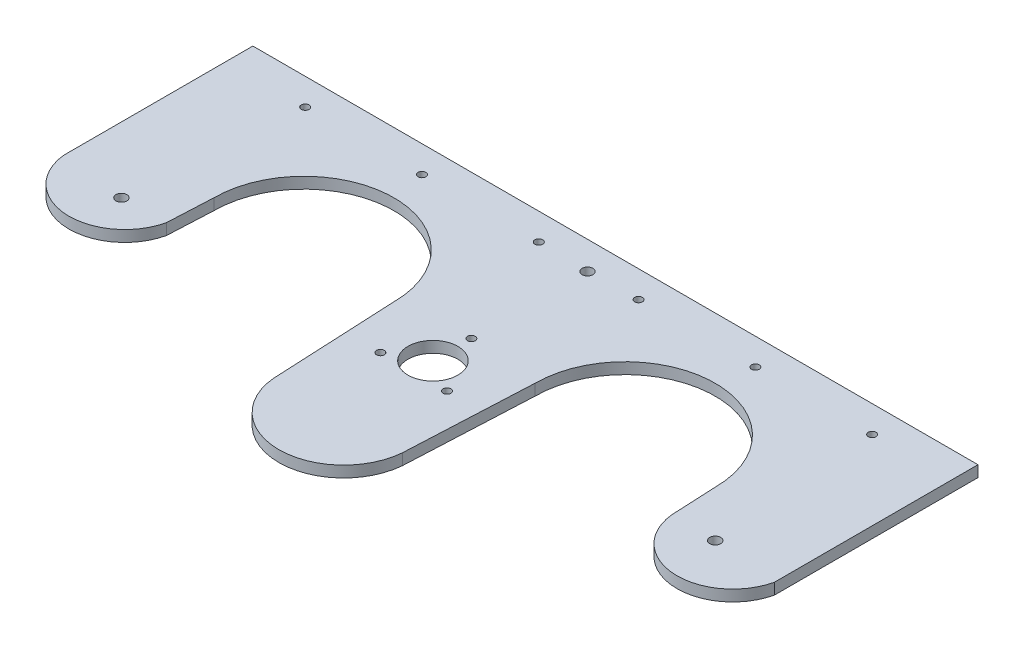
ISO-10303-21;
HEADER;
FILE_DESCRIPTION(('STEP AP214'),'2;1');
FILE_NAME('part.step','',(''),(''),'','','');
FILE_SCHEMA(('AUTOMOTIVE_DESIGN { 1 0 10303 214 1 1 1 1 }'));
ENDSEC;
DATA;
#1=APPLICATION_CONTEXT('core data for automotive mechanical design processes');
#2=APPLICATION_PROTOCOL_DEFINITION('international standard','automotive_design',2000,#1);
#3=PRODUCT_CONTEXT('',#1,'mechanical');
#4=PRODUCT('Part','Part','',(#3));
#5=PRODUCT_RELATED_PRODUCT_CATEGORY('part','',(#4));
#6=PRODUCT_DEFINITION_FORMATION('','',#4);
#7=PRODUCT_DEFINITION_CONTEXT('part definition',#1,'design');
#8=PRODUCT_DEFINITION('design','',#6,#7);
#9=PRODUCT_DEFINITION_SHAPE('','',#8);
#10=(LENGTH_UNIT() NAMED_UNIT(*) SI_UNIT(.MILLI.,.METRE.));
#11=(NAMED_UNIT(*) PLANE_ANGLE_UNIT() SI_UNIT($,.RADIAN.));
#12=(NAMED_UNIT(*) SI_UNIT($,.STERADIAN.) SOLID_ANGLE_UNIT());
#13=UNCERTAINTY_MEASURE_WITH_UNIT(LENGTH_MEASURE(1.E-05),#10,'distance_accuracy_value','');
#14=(GEOMETRIC_REPRESENTATION_CONTEXT(3) GLOBAL_UNCERTAINTY_ASSIGNED_CONTEXT((#13)) GLOBAL_UNIT_ASSIGNED_CONTEXT((#10,
#11,#12)) REPRESENTATION_CONTEXT('',''));
#15=CARTESIAN_POINT('',(0.,0.,0.));
#16=DIRECTION('',(0.,0.,1.));
#17=DIRECTION('',(1.,0.,0.));
#18=AXIS2_PLACEMENT_3D('',#15,#16,#17);
#19=CARTESIAN_POINT('',(0.,4.6,0.));
#20=DIRECTION('',(1.,0.,0.));
#21=DIRECTION('',(0.,0.,-1.));
#22=AXIS2_PLACEMENT_3D('',#19,#20,#21);
#23=PLANE('',#22);
#24=DIRECTION('',(0.,0.,1.));
#25=VECTOR('',#24,1.);
#26=CARTESIAN_POINT('',(0.,0.,0.));
#27=LINE('',#26,#25);
#28=CARTESIAN_POINT('',(0.,0.,-145.));
#29=VERTEX_POINT('',#28);
#30=CARTESIAN_POINT('',(0.,0.,-67.3853154496635));
#31=VERTEX_POINT('',#30);
#32=EDGE_CURVE('E164',#29,#31,#27,.T.);
#33=ORIENTED_EDGE('',*,*,#32,.T.);
#34=DIRECTION('',(0.,1.,0.));
#35=VECTOR('',#34,1.);
#36=CARTESIAN_POINT('',(0.,0.,-67.3853154496635));
#37=LINE('',#36,#35);
#38=CARTESIAN_POINT('',(0.,4.6,-67.3853154496635));
#39=VERTEX_POINT('',#38);
#40=EDGE_CURVE('E254',#31,#39,#37,.T.);
#41=ORIENTED_EDGE('',*,*,#40,.T.);
#42=DIRECTION('',(0.,0.,1.));
#43=VECTOR('',#42,1.);
#44=CARTESIAN_POINT('',(0.,4.6,0.));
#45=LINE('',#44,#43);
#46=CARTESIAN_POINT('',(0.,4.6,-145.));
#47=VERTEX_POINT('',#46);
#48=EDGE_CURVE('E137',#47,#39,#45,.T.);
#49=ORIENTED_EDGE('',*,*,#48,.F.);
#50=DIRECTION('',(0.,-1.,0.));
#51=VECTOR('',#50,1.);
#52=CARTESIAN_POINT('',(0.,4.6,-145.));
#53=LINE('',#52,#51);
#54=EDGE_CURVE('E163',#47,#29,#53,.T.);
#55=ORIENTED_EDGE('',*,*,#54,.T.);
#56=EDGE_LOOP('',(#33,#41,#49,#55));
#57=FACE_BOUND('',#56,.T.);
#58=ADVANCED_FACE('F32',(#57),#23,.F.);
#59=CARTESIAN_POINT('',(298.,4.6,0.));
#60=DIRECTION('',(-1.,0.,0.));
#61=DIRECTION('',(0.,0.,1.));
#62=AXIS2_PLACEMENT_3D('',#59,#60,#61);
#63=PLANE('',#62);
#64=DIRECTION('',(0.,-1.,0.));
#65=VECTOR('',#64,1.);
#66=CARTESIAN_POINT('',(298.,4.6,-145.));
#67=LINE('',#66,#65);
#68=CARTESIAN_POINT('',(298.,4.6,-145.));
#69=VERTEX_POINT('',#68);
#70=CARTESIAN_POINT('',(298.,0.,-145.));
#71=VERTEX_POINT('',#70);
#72=EDGE_CURVE('E172',#69,#71,#67,.T.);
#73=ORIENTED_EDGE('',*,*,#72,.F.);
#74=DIRECTION('',(0.,0.,-1.));
#75=VECTOR('',#74,1.);
#76=CARTESIAN_POINT('',(298.,4.6,0.));
#77=LINE('',#76,#75);
#78=CARTESIAN_POINT('',(298.,4.6,-61.3235794151352));
#79=VERTEX_POINT('',#78);
#80=EDGE_CURVE('E158',#79,#69,#77,.T.);
#81=ORIENTED_EDGE('',*,*,#80,.F.);
#82=DIRECTION('',(0.,1.,0.));
#83=VECTOR('',#82,1.);
#84=CARTESIAN_POINT('',(298.,0.,-61.3235794151352));
#85=LINE('',#84,#83);
#86=CARTESIAN_POINT('',(298.,0.,-61.3235794151352));
#87=VERTEX_POINT('',#86);
#88=EDGE_CURVE('E128',#79,#87,#85,.F.);
#89=ORIENTED_EDGE('',*,*,#88,.T.);
#90=DIRECTION('',(0.,0.,-1.));
#91=VECTOR('',#90,1.);
#92=CARTESIAN_POINT('',(298.,0.,0.));
#93=LINE('',#92,#91);
#94=EDGE_CURVE('E166',#87,#71,#93,.T.);
#95=ORIENTED_EDGE('',*,*,#94,.T.);
#96=EDGE_LOOP('',(#73,#81,#89,#95));
#97=FACE_BOUND('',#96,.T.);
#98=ADVANCED_FACE('F361',(#97),#63,.F.);
#99=CARTESIAN_POINT('',(0.,4.6,-145.));
#100=DIRECTION('',(0.,0.,1.));
#101=DIRECTION('',(1.,0.,0.));
#102=AXIS2_PLACEMENT_3D('',#99,#100,#101);
#103=PLANE('',#102);
#104=DIRECTION('',(-1.,0.,0.));
#105=VECTOR('',#104,1.);
#106=CARTESIAN_POINT('',(0.,0.,-145.));
#107=LINE('',#106,#105);
#108=EDGE_CURVE('E159',#71,#29,#107,.T.);
#109=ORIENTED_EDGE('',*,*,#108,.T.);
#110=ORIENTED_EDGE('',*,*,#54,.F.);
#111=DIRECTION('',(-1.,0.,0.));
#112=VECTOR('',#111,1.);
#113=CARTESIAN_POINT('',(0.,4.6,-145.));
#114=LINE('',#113,#112);
#115=EDGE_CURVE('E161',#69,#47,#114,.T.);
#116=ORIENTED_EDGE('',*,*,#115,.F.);
#117=ORIENTED_EDGE('',*,*,#72,.T.);
#118=EDGE_LOOP('',(#109,#110,#116,#117));
#119=FACE_BOUND('',#118,.T.);
#120=ADVANCED_FACE('F321',(#119),#103,.F.);
#121=CARTESIAN_POINT('',(0.,4.6,0.));
#122=DIRECTION('',(0.,-1.,0.));
#123=DIRECTION('',(0.,0.,-1.));
#124=AXIS2_PLACEMENT_3D('',#121,#122,#123);
#125=PLANE('',#124);
#126=ORIENTED_EDGE('',*,*,#48,.T.);
#127=CARTESIAN_POINT('',(22.7977861678741,4.6,-69.5465525592583));
#128=DIRECTION('',(0.,-1.,0.));
#129=DIRECTION('',(0.,0.,-1.));
#130=AXIS2_PLACEMENT_3D('',#127,#128,#129);
#131=CIRCLE('',#130,22.9);
#132=CARTESIAN_POINT('',(45.1014191533686,4.6,-64.3544474323988));
#133=VERTEX_POINT('',#132);
#134=EDGE_CURVE('E123',#133,#39,#131,.T.);
#135=ORIENTED_EDGE('',*,*,#134,.F.);
#136=DIRECTION('',(-0.048136903485688,0.,0.998840747328026));
#137=VECTOR('',#136,1.);
#138=CARTESIAN_POINT('',(46.,4.6,-83.));
#139=LINE('',#138,#137);
#140=CARTESIAN_POINT('',(46.,4.6,-83.));
#141=VERTEX_POINT('',#140);
#142=EDGE_CURVE('E135',#141,#133,#139,.T.);
#143=ORIENTED_EDGE('',*,*,#142,.F.);
#144=CARTESIAN_POINT('',(83.,4.6,-83.));
#145=DIRECTION('',(0.,1.,0.));
#146=DIRECTION('',(0.,0.,-1.));
#147=AXIS2_PLACEMENT_3D('',#144,#145,#146);
#148=CIRCLE('',#147,37.);
#149=CARTESIAN_POINT('',(120.,4.6,-83.));
#150=VERTEX_POINT('',#149);
#151=EDGE_CURVE('E145',#150,#141,#148,.T.);
#152=ORIENTED_EDGE('',*,*,#151,.F.);
#153=DIRECTION('',(-0.048136903485688,0.,-0.998840747328026));
#154=VECTOR('',#153,1.);
#155=CARTESIAN_POINT('',(120.,4.6,-83.));
#156=LINE('',#155,#154);
#157=CARTESIAN_POINT('',(122.506024096386,4.6,-30.9999999999999));
#158=VERTEX_POINT('',#157);
#159=EDGE_CURVE('E144',#158,#150,#156,.T.);
#160=ORIENTED_EDGE('',*,*,#159,.F.);
#161=CARTESIAN_POINT('',(149.,4.6,-33.2867412736775));
#162=DIRECTION('',(0.,-1.,0.));
#163=DIRECTION('',(0.,0.,1.));
#164=AXIS2_PLACEMENT_3D('',#161,#162,#163);
#165=CIRCLE('',#164,26.5924791028223);
#166=CARTESIAN_POINT('',(175.493975903614,4.6,-30.9999999999999));
#167=VERTEX_POINT('',#166);
#168=EDGE_CURVE('E234',#167,#158,#165,.T.);
#169=ORIENTED_EDGE('',*,*,#168,.F.);
#170=DIRECTION('',(-0.048136903485688,0.,0.998840747328026));
#171=VECTOR('',#170,1.);
#172=CARTESIAN_POINT('',(178.,4.6,-83.));
#173=LINE('',#172,#171);
#174=CARTESIAN_POINT('',(178.,4.6,-83.));
#175=VERTEX_POINT('',#174);
#176=EDGE_CURVE('E155',#175,#167,#173,.T.);
#177=ORIENTED_EDGE('',*,*,#176,.F.);
#178=CARTESIAN_POINT('',(215.,4.6,-83.));
#179=DIRECTION('',(0.,1.,0.));
#180=DIRECTION('',(0.,0.,1.));
#181=AXIS2_PLACEMENT_3D('',#178,#179,#180);
#182=CIRCLE('',#181,37.);
#183=CARTESIAN_POINT('',(252.,4.6,-83.));
#184=VERTEX_POINT('',#183);
#185=EDGE_CURVE('E218',#184,#175,#182,.T.);
#186=ORIENTED_EDGE('',*,*,#185,.F.);
#187=DIRECTION('',(-0.048136903485688,0.,-0.998840747328026));
#188=VECTOR('',#187,1.);
#189=CARTESIAN_POINT('',(252.,4.6,-83.));
#190=LINE('',#189,#188);
#191=CARTESIAN_POINT('',(252.898580846631,4.6,-64.3544474323986));
#192=VERTEX_POINT('',#191);
#193=EDGE_CURVE('E216',#192,#184,#190,.T.);
#194=ORIENTED_EDGE('',*,*,#193,.F.);
#195=CARTESIAN_POINT('',(275.696367014505,4.6,-66.515684541994));
#196=DIRECTION('',(0.,-1.,0.));
#197=DIRECTION('',(0.,0.,-1.));
#198=AXIS2_PLACEMENT_3D('',#195,#196,#197);
#199=CIRCLE('',#198,22.9);
#200=EDGE_CURVE('E56',#79,#192,#199,.T.);
#201=ORIENTED_EDGE('',*,*,#200,.F.);
#202=ORIENTED_EDGE('',*,*,#80,.T.);
#203=ORIENTED_EDGE('',*,*,#115,.T.);
#204=EDGE_LOOP('',(#126,#135,#143,#152,#160,#169,#177,#186,#194,#201,#202,#203));
#205=FACE_BOUND('',#204,.T.);
#206=CARTESIAN_POINT('',(149.,4.6,-70.));
#207=DIRECTION('',(0.,1.,0.));
#208=DIRECTION('',(0.,0.,1.));
#209=AXIS2_PLACEMENT_3D('',#206,#207,#208);
#210=CIRCLE('',#209,10.25);
#211=CARTESIAN_POINT('',(149.,4.6,-59.75));
#212=VERTEX_POINT('',#211);
#213=EDGE_CURVE('E210',#212,#212,#210,.T.);
#214=ORIENTED_EDGE('',*,*,#213,.F.);
#215=EDGE_LOOP('',(#214));
#216=FACE_BOUND('',#215,.T.);
#217=CARTESIAN_POINT('',(265.5,4.6,-134.));
#218=DIRECTION('',(0.,1.,0.));
#219=DIRECTION('',(0.,0.,-1.));
#220=AXIS2_PLACEMENT_3D('',#217,#218,#219);
#221=CIRCLE('',#220,1.59999999999996);
#222=CARTESIAN_POINT('',(265.5,4.6,-135.6));
#223=VERTEX_POINT('',#222);
#224=EDGE_CURVE('E195',#223,#223,#221,.T.);
#225=ORIENTED_EDGE('',*,*,#224,.F.);
#226=EDGE_LOOP('',(#225));
#227=FACE_BOUND('',#226,.T.);
#228=CARTESIAN_POINT('',(169.5,4.6,-134.));
#229=DIRECTION('',(0.,1.,0.));
#230=DIRECTION('',(0.,0.,-1.));
#231=AXIS2_PLACEMENT_3D('',#228,#229,#230);
#232=CIRCLE('',#231,1.59999999999999);
#233=CARTESIAN_POINT('',(169.5,4.6,-135.6));
#234=VERTEX_POINT('',#233);
#235=EDGE_CURVE('E204',#234,#234,#232,.T.);
#236=ORIENTED_EDGE('',*,*,#235,.F.);
#237=EDGE_LOOP('',(#236));
#238=FACE_BOUND('',#237,.T.);
#239=CARTESIAN_POINT('',(217.5,4.6,-134.));
#240=DIRECTION('',(0.,1.,0.));
#241=DIRECTION('',(0.,0.,-1.));
#242=AXIS2_PLACEMENT_3D('',#239,#240,#241);
#243=CIRCLE('',#242,1.60000000000002);
#244=CARTESIAN_POINT('',(217.5,4.6,-135.6));
#245=VERTEX_POINT('',#244);
#246=EDGE_CURVE('E309',#245,#245,#243,.T.);
#247=ORIENTED_EDGE('',*,*,#246,.F.);
#248=EDGE_LOOP('',(#247));
#249=FACE_BOUND('',#248,.T.);
#250=CARTESIAN_POINT('',(128.5,4.6,-134.));
#251=DIRECTION('',(0.,1.,0.));
#252=DIRECTION('',(0.,0.,1.));
#253=AXIS2_PLACEMENT_3D('',#250,#251,#252);
#254=CIRCLE('',#253,1.59999999999999);
#255=CARTESIAN_POINT('',(128.5,4.6,-132.4));
#256=VERTEX_POINT('',#255);
#257=EDGE_CURVE('E303',#256,#256,#254,.T.);
#258=ORIENTED_EDGE('',*,*,#257,.F.);
#259=EDGE_LOOP('',(#258));
#260=FACE_BOUND('',#259,.T.);
#261=CARTESIAN_POINT('',(80.5,4.6,-134.));
#262=DIRECTION('',(0.,1.,0.));
#263=DIRECTION('',(0.,0.,1.));
#264=AXIS2_PLACEMENT_3D('',#261,#262,#263);
#265=CIRCLE('',#264,1.6);
#266=CARTESIAN_POINT('',(80.5,4.6,-132.4));
#267=VERTEX_POINT('',#266);
#268=EDGE_CURVE('E297',#267,#267,#265,.T.);
#269=ORIENTED_EDGE('',*,*,#268,.F.);
#270=EDGE_LOOP('',(#269));
#271=FACE_BOUND('',#270,.T.);
#272=CARTESIAN_POINT('',(32.5,4.6,-134.));
#273=DIRECTION('',(0.,1.,0.));
#274=DIRECTION('',(0.,0.,1.));
#275=AXIS2_PLACEMENT_3D('',#272,#273,#274);
#276=CIRCLE('',#275,1.6);
#277=CARTESIAN_POINT('',(32.5,4.6,-132.4));
#278=VERTEX_POINT('',#277);
#279=EDGE_CURVE('E291',#278,#278,#276,.T.);
#280=ORIENTED_EDGE('',*,*,#279,.F.);
#281=EDGE_LOOP('',(#280));
#282=FACE_BOUND('',#281,.T.);
#283=CARTESIAN_POINT('',(271.,4.6,-64.));
#284=DIRECTION('',(0.,1.,0.));
#285=DIRECTION('',(0.,0.,-1.));
#286=AXIS2_PLACEMENT_3D('',#283,#284,#285);
#287=CIRCLE('',#286,2.25000000000007);
#288=CARTESIAN_POINT('',(271.,4.6,-66.2500000000001));
#289=VERTEX_POINT('',#288);
#290=EDGE_CURVE('E267',#289,#289,#287,.T.);
#291=ORIENTED_EDGE('',*,*,#290,.F.);
#292=EDGE_LOOP('',(#291));
#293=FACE_BOUND('',#292,.T.);
#294=CARTESIAN_POINT('',(149.,4.6,-133.51941054579));
#295=DIRECTION('',(0.,1.,0.));
#296=DIRECTION('',(0.,0.,1.));
#297=AXIS2_PLACEMENT_3D('',#294,#295,#296);
#298=CIRCLE('',#297,2.25000000000001);
#299=CARTESIAN_POINT('',(149.,4.6,-131.26941054579));
#300=VERTEX_POINT('',#299);
#301=EDGE_CURVE('E284',#300,#300,#298,.T.);
#302=ORIENTED_EDGE('',*,*,#301,.F.);
#303=EDGE_LOOP('',(#302));
#304=FACE_BOUND('',#303,.T.);
#305=CARTESIAN_POINT('',(27.,4.6,-64.));
#306=DIRECTION('',(0.,1.,0.));
#307=DIRECTION('',(0.,0.,1.));
#308=AXIS2_PLACEMENT_3D('',#305,#306,#307);
#309=CIRCLE('',#308,2.25);
#310=CARTESIAN_POINT('',(27.,4.6,-61.75));
#311=VERTEX_POINT('',#310);
#312=EDGE_CURVE('E190',#311,#311,#309,.T.);
#313=ORIENTED_EDGE('',*,*,#312,.F.);
#314=EDGE_LOOP('',(#313));
#315=FACE_BOUND('',#314,.T.);
#316=CARTESIAN_POINT('',(162.691861633832,4.6,-62.095));
#317=DIRECTION('',(0.,1.,0.));
#318=DIRECTION('',(0.,0.,1.));
#319=AXIS2_PLACEMENT_3D('',#316,#317,#318);
#320=CIRCLE('',#319,1.59999999999999);
#321=CARTESIAN_POINT('',(162.691861633832,4.6,-60.495));
#322=VERTEX_POINT('',#321);
#323=EDGE_CURVE('E261',#322,#322,#320,.T.);
#324=ORIENTED_EDGE('',*,*,#323,.F.);
#325=EDGE_LOOP('',(#324));
#326=FACE_BOUND('',#325,.T.);
#327=CARTESIAN_POINT('',(135.308138366168,4.6,-62.095));
#328=DIRECTION('',(0.,1.,0.));
#329=DIRECTION('',(0.,0.,1.));
#330=AXIS2_PLACEMENT_3D('',#327,#328,#329);
#331=CIRCLE('',#330,1.59999999999999);
#332=CARTESIAN_POINT('',(135.308138366168,4.6,-60.495));
#333=VERTEX_POINT('',#332);
#334=EDGE_CURVE('E274',#333,#333,#331,.T.);
#335=ORIENTED_EDGE('',*,*,#334,.F.);
#336=EDGE_LOOP('',(#335));
#337=FACE_BOUND('',#336,.T.);
#338=CARTESIAN_POINT('',(149.,4.6,-85.81));
#339=DIRECTION('',(0.,1.,0.));
#340=DIRECTION('',(0.,0.,1.));
#341=AXIS2_PLACEMENT_3D('',#338,#339,#340);
#342=CIRCLE('',#341,1.59999999999999);
#343=CARTESIAN_POINT('',(149.,4.6,-84.21));
#344=VERTEX_POINT('',#343);
#345=EDGE_CURVE('E268',#344,#344,#342,.T.);
#346=ORIENTED_EDGE('',*,*,#345,.F.);
#347=EDGE_LOOP('',(#346));
#348=FACE_BOUND('',#347,.T.);
#349=ADVANCED_FACE('F132',(#205,#216,#227,#238,#249,#260,#271,#282,#293,#304,#315,#326,#337,
#348),#125,.F.);
#350=CARTESIAN_POINT('',(0.,0.,0.));
#351=DIRECTION('',(0.,-1.,0.));
#352=DIRECTION('',(0.,0.,-1.));
#353=AXIS2_PLACEMENT_3D('',#350,#351,#352);
#354=PLANE('',#353);
#355=CARTESIAN_POINT('',(22.7977861678741,0.,-69.5465525592583));
#356=DIRECTION('',(0.,-1.,0.));
#357=DIRECTION('',(0.,0.,-1.));
#358=AXIS2_PLACEMENT_3D('',#355,#356,#357);
#359=CIRCLE('',#358,22.9);
#360=CARTESIAN_POINT('',(45.1014191533686,0.,-64.3544474323976));
#361=VERTEX_POINT('',#360);
#362=EDGE_CURVE('E48',#361,#31,#359,.T.);
#363=ORIENTED_EDGE('',*,*,#362,.T.);
#364=ORIENTED_EDGE('',*,*,#32,.F.);
#365=ORIENTED_EDGE('',*,*,#108,.F.);
#366=ORIENTED_EDGE('',*,*,#94,.F.);
#367=CARTESIAN_POINT('',(275.696367014505,0.,-66.515684541994));
#368=DIRECTION('',(0.,-1.,0.));
#369=DIRECTION('',(0.,0.,-1.));
#370=AXIS2_PLACEMENT_3D('',#367,#368,#369);
#371=CIRCLE('',#370,22.9);
#372=CARTESIAN_POINT('',(252.898580846631,0.,-64.3544474323988));
#373=VERTEX_POINT('',#372);
#374=EDGE_CURVE('E246',#87,#373,#371,.T.);
#375=ORIENTED_EDGE('',*,*,#374,.T.);
#376=DIRECTION('',(0.048136903485688,0.,0.998840747328026));
#377=VECTOR('',#376,1.);
#378=CARTESIAN_POINT('',(255.406806661839,0.,-12.3087617668356));
#379=LINE('',#378,#377);
#380=CARTESIAN_POINT('',(252.,0.,-83.));
#381=VERTEX_POINT('',#380);
#382=EDGE_CURVE('E182',#381,#373,#379,.T.);
#383=ORIENTED_EDGE('',*,*,#382,.F.);
#384=CARTESIAN_POINT('',(215.,0.,-83.));
#385=DIRECTION('',(0.,-1.,0.));
#386=DIRECTION('',(0.,0.,-1.));
#387=AXIS2_PLACEMENT_3D('',#384,#385,#386);
#388=CIRCLE('',#387,37.);
#389=CARTESIAN_POINT('',(178.,0.,-83.));
#390=VERTEX_POINT('',#389);
#391=EDGE_CURVE('E40',#390,#381,#388,.T.);
#392=ORIENTED_EDGE('',*,*,#391,.F.);
#393=DIRECTION('',(0.048136903485688,0.,-0.998840747328026));
#394=VECTOR('',#393,1.);
#395=CARTESIAN_POINT('',(173.596813902969,0.,8.3661115133961));
#396=LINE('',#395,#394);
#397=CARTESIAN_POINT('',(175.493975903614,0.,-30.9999999999999));
#398=VERTEX_POINT('',#397);
#399=EDGE_CURVE('E11',#398,#390,#396,.T.);
#400=ORIENTED_EDGE('',*,*,#399,.F.);
#401=CARTESIAN_POINT('',(149.,0.,-33.2867412736775));
#402=DIRECTION('',(0.,-1.,0.));
#403=DIRECTION('',(0.,0.,1.));
#404=AXIS2_PLACEMENT_3D('',#401,#402,#403);
#405=CIRCLE('',#404,26.5924791028223);
#406=CARTESIAN_POINT('',(122.506024096386,0.,-30.9999999999999));
#407=VERTEX_POINT('',#406);
#408=EDGE_CURVE('E256',#398,#407,#405,.T.);
#409=ORIENTED_EDGE('',*,*,#408,.T.);
#410=DIRECTION('',(0.048136903485688,0.,0.998840747328026));
#411=VECTOR('',#410,1.);
#412=CARTESIAN_POINT('',(123.712671976828,0.,-5.96205648081101));
#413=LINE('',#412,#411);
#414=CARTESIAN_POINT('',(120.,0.,-83.));
#415=VERTEX_POINT('',#414);
#416=EDGE_CURVE('E179',#415,#407,#413,.T.);
#417=ORIENTED_EDGE('',*,*,#416,.F.);
#418=CARTESIAN_POINT('',(83.,0.,-83.));
#419=DIRECTION('',(0.,-1.,0.));
#420=DIRECTION('',(0.,0.,-1.));
#421=AXIS2_PLACEMENT_3D('',#418,#419,#420);
#422=CIRCLE('',#421,37.);
#423=CARTESIAN_POINT('',(46.,0.,-83.));
#424=VERTEX_POINT('',#423);
#425=EDGE_CURVE('E177',#424,#415,#422,.T.);
#426=ORIENTED_EDGE('',*,*,#425,.F.);
#427=DIRECTION('',(0.048136903485688,0.,-0.998840747328026));
#428=VECTOR('',#427,1.);
#429=CARTESIAN_POINT('',(41.902679217958,0.,2.01940622737147));
#430=LINE('',#429,#428);
#431=EDGE_CURVE('E175',#361,#424,#430,.T.);
#432=ORIENTED_EDGE('',*,*,#431,.F.);
#433=EDGE_LOOP('',(#363,#364,#365,#366,#375,#383,#392,#400,#409,#417,#426,#432));
#434=FACE_BOUND('',#433,.T.);
#435=CARTESIAN_POINT('',(149.,0.,-85.81));
#436=DIRECTION('',(0.,1.,0.));
#437=DIRECTION('',(0.,0.,1.));
#438=AXIS2_PLACEMENT_3D('',#435,#436,#437);
#439=CIRCLE('',#438,1.59999999999999);
#440=CARTESIAN_POINT('',(149.,0.,-84.21));
#441=VERTEX_POINT('',#440);
#442=EDGE_CURVE('E264',#441,#441,#439,.T.);
#443=ORIENTED_EDGE('',*,*,#442,.T.);
#444=EDGE_LOOP('',(#443));
#445=FACE_BOUND('',#444,.T.);
#446=CARTESIAN_POINT('',(135.308138366168,0.,-62.095));
#447=DIRECTION('',(0.,1.,0.));
#448=DIRECTION('',(0.,0.,1.));
#449=AXIS2_PLACEMENT_3D('',#446,#447,#448);
#450=CIRCLE('',#449,1.59999999999999);
#451=CARTESIAN_POINT('',(135.308138366168,0.,-60.495));
#452=VERTEX_POINT('',#451);
#453=EDGE_CURVE('E271',#452,#452,#450,.T.);
#454=ORIENTED_EDGE('',*,*,#453,.T.);
#455=EDGE_LOOP('',(#454));
#456=FACE_BOUND('',#455,.T.);
#457=CARTESIAN_POINT('',(162.691861633832,0.,-62.095));
#458=DIRECTION('',(0.,1.,0.));
#459=DIRECTION('',(0.,0.,1.));
#460=AXIS2_PLACEMENT_3D('',#457,#458,#459);
#461=CIRCLE('',#460,1.59999999999999);
#462=CARTESIAN_POINT('',(162.691861633832,0.,-60.495));
#463=VERTEX_POINT('',#462);
#464=EDGE_CURVE('E277',#463,#463,#461,.T.);
#465=ORIENTED_EDGE('',*,*,#464,.T.);
#466=EDGE_LOOP('',(#465));
#467=FACE_BOUND('',#466,.T.);
#468=CARTESIAN_POINT('',(27.,0.,-64.));
#469=DIRECTION('',(0.,-1.,0.));
#470=DIRECTION('',(0.,0.,-1.));
#471=AXIS2_PLACEMENT_3D('',#468,#469,#470);
#472=CIRCLE('',#471,2.25);
#473=CARTESIAN_POINT('',(27.,0.,-66.25));
#474=VERTEX_POINT('',#473);
#475=EDGE_CURVE('E35',#474,#474,#472,.T.);
#476=ORIENTED_EDGE('',*,*,#475,.F.);
#477=EDGE_LOOP('',(#476));
#478=FACE_BOUND('',#477,.T.);
#479=CARTESIAN_POINT('',(149.,0.,-133.51941054579));
#480=DIRECTION('',(0.,-1.,0.));
#481=DIRECTION('',(0.,0.,-1.));
#482=AXIS2_PLACEMENT_3D('',#479,#480,#481);
#483=CIRCLE('',#482,2.25000000000001);
#484=CARTESIAN_POINT('',(149.,0.,-135.76941054579));
#485=VERTEX_POINT('',#484);
#486=EDGE_CURVE('E189',#485,#485,#483,.T.);
#487=ORIENTED_EDGE('',*,*,#486,.F.);
#488=EDGE_LOOP('',(#487));
#489=FACE_BOUND('',#488,.T.);
#490=CARTESIAN_POINT('',(271.,0.,-64.));
#491=DIRECTION('',(0.,-1.,0.));
#492=DIRECTION('',(0.,0.,-1.));
#493=AXIS2_PLACEMENT_3D('',#490,#491,#492);
#494=CIRCLE('',#493,2.25000000000007);
#495=CARTESIAN_POINT('',(271.,0.,-66.2500000000001));
#496=VERTEX_POINT('',#495);
#497=EDGE_CURVE('E187',#496,#496,#494,.T.);
#498=ORIENTED_EDGE('',*,*,#497,.F.);
#499=EDGE_LOOP('',(#498));
#500=FACE_BOUND('',#499,.T.);
#501=CARTESIAN_POINT('',(32.5,0.,-134.));
#502=DIRECTION('',(0.,1.,0.));
#503=DIRECTION('',(0.,0.,1.));
#504=AXIS2_PLACEMENT_3D('',#501,#502,#503);
#505=CIRCLE('',#504,1.6);
#506=CARTESIAN_POINT('',(32.5,0.,-132.4));
#507=VERTEX_POINT('',#506);
#508=EDGE_CURVE('E213',#507,#507,#505,.T.);
#509=ORIENTED_EDGE('',*,*,#508,.T.);
#510=EDGE_LOOP('',(#509));
#511=FACE_BOUND('',#510,.T.);
#512=CARTESIAN_POINT('',(80.5,0.,-134.));
#513=DIRECTION('',(0.,1.,0.));
#514=DIRECTION('',(0.,0.,1.));
#515=AXIS2_PLACEMENT_3D('',#512,#513,#514);
#516=CIRCLE('',#515,1.6);
#517=CARTESIAN_POINT('',(80.5,0.,-132.4));
#518=VERTEX_POINT('',#517);
#519=EDGE_CURVE('E294',#518,#518,#516,.T.);
#520=ORIENTED_EDGE('',*,*,#519,.T.);
#521=EDGE_LOOP('',(#520));
#522=FACE_BOUND('',#521,.T.);
#523=CARTESIAN_POINT('',(128.5,0.,-134.));
#524=DIRECTION('',(0.,1.,0.));
#525=DIRECTION('',(0.,0.,1.));
#526=AXIS2_PLACEMENT_3D('',#523,#524,#525);
#527=CIRCLE('',#526,1.59999999999999);
#528=CARTESIAN_POINT('',(128.5,0.,-132.4));
#529=VERTEX_POINT('',#528);
#530=EDGE_CURVE('E300',#529,#529,#527,.T.);
#531=ORIENTED_EDGE('',*,*,#530,.T.);
#532=EDGE_LOOP('',(#531));
#533=FACE_BOUND('',#532,.T.);
#534=CARTESIAN_POINT('',(217.5,0.,-134.));
#535=DIRECTION('',(0.,1.,0.));
#536=DIRECTION('',(0.,0.,-1.));
#537=AXIS2_PLACEMENT_3D('',#534,#535,#536);
#538=CIRCLE('',#537,1.60000000000002);
#539=CARTESIAN_POINT('',(217.5,0.,-135.6));
#540=VERTEX_POINT('',#539);
#541=EDGE_CURVE('E306',#540,#540,#538,.T.);
#542=ORIENTED_EDGE('',*,*,#541,.T.);
#543=EDGE_LOOP('',(#542));
#544=FACE_BOUND('',#543,.T.);
#545=CARTESIAN_POINT('',(169.5,0.,-134.));
#546=DIRECTION('',(0.,1.,0.));
#547=DIRECTION('',(0.,0.,-1.));
#548=AXIS2_PLACEMENT_3D('',#545,#546,#547);
#549=CIRCLE('',#548,1.59999999999999);
#550=CARTESIAN_POINT('',(169.5,0.,-135.6));
#551=VERTEX_POINT('',#550);
#552=EDGE_CURVE('E312',#551,#551,#549,.T.);
#553=ORIENTED_EDGE('',*,*,#552,.T.);
#554=EDGE_LOOP('',(#553));
#555=FACE_BOUND('',#554,.T.);
#556=CARTESIAN_POINT('',(265.5,0.,-134.));
#557=DIRECTION('',(0.,1.,0.));
#558=DIRECTION('',(0.,0.,-1.));
#559=AXIS2_PLACEMENT_3D('',#556,#557,#558);
#560=CIRCLE('',#559,1.59999999999996);
#561=CARTESIAN_POINT('',(265.5,0.,-135.6));
#562=VERTEX_POINT('',#561);
#563=EDGE_CURVE('E199',#562,#562,#560,.T.);
#564=ORIENTED_EDGE('',*,*,#563,.T.);
#565=EDGE_LOOP('',(#564));
#566=FACE_BOUND('',#565,.T.);
#567=CARTESIAN_POINT('',(149.,0.,-70.));
#568=DIRECTION('',(0.,1.,0.));
#569=DIRECTION('',(0.,0.,1.));
#570=AXIS2_PLACEMENT_3D('',#567,#568,#569);
#571=CIRCLE('',#570,10.25);
#572=CARTESIAN_POINT('',(149.,0.,-59.75));
#573=VERTEX_POINT('',#572);
#574=EDGE_CURVE('E148',#573,#573,#571,.T.);
#575=ORIENTED_EDGE('',*,*,#574,.T.);
#576=EDGE_LOOP('',(#575));
#577=FACE_BOUND('',#576,.T.);
#578=ADVANCED_FACE('F241',(#434,#445,#456,#467,#478,#489,#500,#511,#522,#533,#544,#555,#566,
#577),#354,.T.);
#579=CARTESIAN_POINT('',(83.,-42.,-83.));
#580=DIRECTION('',(0.,1.,0.));
#581=DIRECTION('',(0.,0.,1.));
#582=AXIS2_PLACEMENT_3D('',#579,#580,#581);
#583=CYLINDRICAL_SURFACE('',#582,37.);
#584=ORIENTED_EDGE('',*,*,#425,.T.);
#585=DIRECTION('',(0.,1.,0.));
#586=VECTOR('',#585,1.);
#587=CARTESIAN_POINT('',(120.,-42.,-83.));
#588=LINE('',#587,#586);
#589=EDGE_CURVE('E152',#415,#150,#588,.T.);
#590=ORIENTED_EDGE('',*,*,#589,.T.);
#591=ORIENTED_EDGE('',*,*,#151,.T.);
#592=DIRECTION('',(0.,1.,0.));
#593=VECTOR('',#592,1.);
#594=CARTESIAN_POINT('',(46.,-42.,-83.));
#595=LINE('',#594,#593);
#596=EDGE_CURVE('E142',#424,#141,#595,.T.);
#597=ORIENTED_EDGE('',*,*,#596,.F.);
#598=EDGE_LOOP('',(#584,#590,#591,#597));
#599=FACE_BOUND('',#598,.T.);
#600=ADVANCED_FACE('F374',(#599),#583,.F.);
#601=CARTESIAN_POINT('',(120.,-42.,-83.));
#602=DIRECTION('',(0.998840747328026,0.,-0.048136903485688));
#603=DIRECTION('',(-0.048136903485688,0.,-0.998840747328026));
#604=AXIS2_PLACEMENT_3D('',#601,#602,#603);
#605=PLANE('',#604);
#606=ORIENTED_EDGE('',*,*,#416,.T.);
#607=DIRECTION('',(0.,1.,0.));
#608=VECTOR('',#607,1.);
#609=CARTESIAN_POINT('',(122.506024096386,0.,-30.9999999999999));
#610=LINE('',#609,#608);
#611=EDGE_CURVE('E258',#407,#158,#610,.T.);
#612=ORIENTED_EDGE('',*,*,#611,.T.);
#613=ORIENTED_EDGE('',*,*,#159,.T.);
#614=ORIENTED_EDGE('',*,*,#589,.F.);
#615=EDGE_LOOP('',(#606,#612,#613,#614));
#616=FACE_BOUND('',#615,.T.);
#617=ADVANCED_FACE('F377',(#616),#605,.F.);
#618=CARTESIAN_POINT('',(46.,-42.,-83.));
#619=DIRECTION('',(-0.998840747328026,0.,-0.048136903485688));
#620=DIRECTION('',(-0.048136903485688,0.,0.998840747328026));
#621=AXIS2_PLACEMENT_3D('',#618,#619,#620);
#622=PLANE('',#621);
#623=ORIENTED_EDGE('',*,*,#142,.T.);
#624=DIRECTION('',(0.,1.,0.));
#625=VECTOR('',#624,1.);
#626=CARTESIAN_POINT('',(45.1014191533686,0.,-64.3544474323988));
#627=LINE('',#626,#625);
#628=EDGE_CURVE('E120',#361,#133,#627,.T.);
#629=ORIENTED_EDGE('',*,*,#628,.F.);
#630=ORIENTED_EDGE('',*,*,#431,.T.);
#631=ORIENTED_EDGE('',*,*,#596,.T.);
#632=EDGE_LOOP('',(#623,#629,#630,#631));
#633=FACE_BOUND('',#632,.T.);
#634=ADVANCED_FACE('F140',(#633),#622,.F.);
#635=CARTESIAN_POINT('',(178.,-42.,-83.));
#636=DIRECTION('',(-0.998840747328026,0.,-0.048136903485688));
#637=DIRECTION('',(-0.048136903485688,0.,0.998840747328026));
#638=AXIS2_PLACEMENT_3D('',#635,#636,#637);
#639=PLANE('',#638);
#640=ORIENTED_EDGE('',*,*,#176,.T.);
#641=DIRECTION('',(0.,1.,0.));
#642=VECTOR('',#641,1.);
#643=CARTESIAN_POINT('',(175.493975903614,0.,-30.9999999999999));
#644=LINE('',#643,#642);
#645=EDGE_CURVE('E238',#398,#167,#644,.T.);
#646=ORIENTED_EDGE('',*,*,#645,.F.);
#647=ORIENTED_EDGE('',*,*,#399,.T.);
#648=DIRECTION('',(0.,1.,0.));
#649=VECTOR('',#648,1.);
#650=CARTESIAN_POINT('',(178.,-42.,-83.));
#651=LINE('',#650,#649);
#652=EDGE_CURVE('E167',#390,#175,#651,.T.);
#653=ORIENTED_EDGE('',*,*,#652,.T.);
#654=EDGE_LOOP('',(#640,#646,#647,#653));
#655=FACE_BOUND('',#654,.T.);
#656=ADVANCED_FACE('F237',(#655),#639,.F.);
#657=CARTESIAN_POINT('',(215.,-42.,-83.));
#658=DIRECTION('',(0.,1.,0.));
#659=DIRECTION('',(0.,0.,1.));
#660=AXIS2_PLACEMENT_3D('',#657,#658,#659);
#661=CYLINDRICAL_SURFACE('',#660,37.);
#662=ORIENTED_EDGE('',*,*,#391,.T.);
#663=DIRECTION('',(0.,1.,0.));
#664=VECTOR('',#663,1.);
#665=CARTESIAN_POINT('',(252.,-42.,-83.));
#666=LINE('',#665,#664);
#667=EDGE_CURVE('E221',#381,#184,#666,.T.);
#668=ORIENTED_EDGE('',*,*,#667,.T.);
#669=ORIENTED_EDGE('',*,*,#185,.T.);
#670=ORIENTED_EDGE('',*,*,#652,.F.);
#671=EDGE_LOOP('',(#662,#668,#669,#670));
#672=FACE_BOUND('',#671,.T.);
#673=ADVANCED_FACE('F225',(#672),#661,.F.);
#674=CARTESIAN_POINT('',(252.,-42.,-83.));
#675=DIRECTION('',(0.998840747328026,0.,-0.048136903485688));
#676=DIRECTION('',(-0.048136903485688,0.,-0.998840747328026));
#677=AXIS2_PLACEMENT_3D('',#674,#675,#676);
#678=PLANE('',#677);
#679=ORIENTED_EDGE('',*,*,#382,.T.);
#680=DIRECTION('',(0.,1.,0.));
#681=VECTOR('',#680,1.);
#682=CARTESIAN_POINT('',(252.898580846631,0.,-64.3544474323988));
#683=LINE('',#682,#681);
#684=EDGE_CURVE('E138',#373,#192,#683,.T.);
#685=ORIENTED_EDGE('',*,*,#684,.T.);
#686=ORIENTED_EDGE('',*,*,#193,.T.);
#687=ORIENTED_EDGE('',*,*,#667,.F.);
#688=EDGE_LOOP('',(#679,#685,#686,#687));
#689=FACE_BOUND('',#688,.T.);
#690=ADVANCED_FACE('F247',(#689),#678,.F.);
#691=CARTESIAN_POINT('',(149.,0.,-70.));
#692=DIRECTION('',(0.,1.,0.));
#693=DIRECTION('',(0.,0.,1.));
#694=AXIS2_PLACEMENT_3D('',#691,#692,#693);
#695=CYLINDRICAL_SURFACE('',#694,10.25);
#696=ORIENTED_EDGE('',*,*,#574,.F.);
#697=EDGE_LOOP('',(#696));
#698=FACE_BOUND('',#697,.T.);
#699=ORIENTED_EDGE('',*,*,#213,.T.);
#700=EDGE_LOOP('',(#699));
#701=FACE_BOUND('',#700,.T.);
#702=ADVANCED_FACE('F420',(#698,#701),#695,.F.);
#703=CARTESIAN_POINT('',(265.5,0.,-134.));
#704=DIRECTION('',(0.,1.,0.));
#705=DIRECTION('',(0.,0.,1.));
#706=AXIS2_PLACEMENT_3D('',#703,#704,#705);
#707=CYLINDRICAL_SURFACE('',#706,1.59999999999996);
#708=ORIENTED_EDGE('',*,*,#563,.F.);
#709=EDGE_LOOP('',(#708));
#710=FACE_BOUND('',#709,.T.);
#711=ORIENTED_EDGE('',*,*,#224,.T.);
#712=EDGE_LOOP('',(#711));
#713=FACE_BOUND('',#712,.T.);
#714=ADVANCED_FACE('F567',(#710,#713),#707,.F.);
#715=CARTESIAN_POINT('',(169.5,0.,-134.));
#716=DIRECTION('',(0.,1.,0.));
#717=DIRECTION('',(0.,0.,1.));
#718=AXIS2_PLACEMENT_3D('',#715,#716,#717);
#719=CYLINDRICAL_SURFACE('',#718,1.59999999999999);
#720=ORIENTED_EDGE('',*,*,#552,.F.);
#721=EDGE_LOOP('',(#720));
#722=FACE_BOUND('',#721,.T.);
#723=ORIENTED_EDGE('',*,*,#235,.T.);
#724=EDGE_LOOP('',(#723));
#725=FACE_BOUND('',#724,.T.);
#726=ADVANCED_FACE('F317',(#722,#725),#719,.F.);
#727=CARTESIAN_POINT('',(217.5,0.,-134.));
#728=DIRECTION('',(0.,1.,0.));
#729=DIRECTION('',(0.,0.,1.));
#730=AXIS2_PLACEMENT_3D('',#727,#728,#729);
#731=CYLINDRICAL_SURFACE('',#730,1.60000000000002);
#732=ORIENTED_EDGE('',*,*,#541,.F.);
#733=EDGE_LOOP('',(#732));
#734=FACE_BOUND('',#733,.T.);
#735=ORIENTED_EDGE('',*,*,#246,.T.);
#736=EDGE_LOOP('',(#735));
#737=FACE_BOUND('',#736,.T.);
#738=ADVANCED_FACE('F548',(#734,#737),#731,.F.);
#739=CARTESIAN_POINT('',(128.5,0.,-134.));
#740=DIRECTION('',(0.,1.,0.));
#741=DIRECTION('',(0.,0.,1.));
#742=AXIS2_PLACEMENT_3D('',#739,#740,#741);
#743=CYLINDRICAL_SURFACE('',#742,1.59999999999999);
#744=ORIENTED_EDGE('',*,*,#530,.F.);
#745=EDGE_LOOP('',(#744));
#746=FACE_BOUND('',#745,.T.);
#747=ORIENTED_EDGE('',*,*,#257,.T.);
#748=EDGE_LOOP('',(#747));
#749=FACE_BOUND('',#748,.T.);
#750=ADVANCED_FACE('F538',(#746,#749),#743,.F.);
#751=CARTESIAN_POINT('',(80.5,0.,-134.));
#752=DIRECTION('',(0.,1.,0.));
#753=DIRECTION('',(0.,0.,1.));
#754=AXIS2_PLACEMENT_3D('',#751,#752,#753);
#755=CYLINDRICAL_SURFACE('',#754,1.6);
#756=ORIENTED_EDGE('',*,*,#519,.F.);
#757=EDGE_LOOP('',(#756));
#758=FACE_BOUND('',#757,.T.);
#759=ORIENTED_EDGE('',*,*,#268,.T.);
#760=EDGE_LOOP('',(#759));
#761=FACE_BOUND('',#760,.T.);
#762=ADVANCED_FACE('F528',(#758,#761),#755,.F.);
#763=CARTESIAN_POINT('',(32.5,0.,-134.));
#764=DIRECTION('',(0.,1.,0.));
#765=DIRECTION('',(0.,0.,1.));
#766=AXIS2_PLACEMENT_3D('',#763,#764,#765);
#767=CYLINDRICAL_SURFACE('',#766,1.6);
#768=ORIENTED_EDGE('',*,*,#508,.F.);
#769=EDGE_LOOP('',(#768));
#770=FACE_BOUND('',#769,.T.);
#771=ORIENTED_EDGE('',*,*,#279,.T.);
#772=EDGE_LOOP('',(#771));
#773=FACE_BOUND('',#772,.T.);
#774=ADVANCED_FACE('F518',(#770,#773),#767,.F.);
#775=CARTESIAN_POINT('',(271.,-30.4,-64.));
#776=DIRECTION('',(0.,1.,0.));
#777=DIRECTION('',(0.,0.,1.));
#778=AXIS2_PLACEMENT_3D('',#775,#776,#777);
#779=CYLINDRICAL_SURFACE('',#778,2.25000000000007);
#780=ORIENTED_EDGE('',*,*,#497,.T.);
#781=EDGE_LOOP('',(#780));
#782=FACE_BOUND('',#781,.T.);
#783=ORIENTED_EDGE('',*,*,#290,.T.);
#784=EDGE_LOOP('',(#783));
#785=FACE_BOUND('',#784,.T.);
#786=ADVANCED_FACE('F509',(#782,#785),#779,.F.);
#787=CARTESIAN_POINT('',(149.,-30.4,-133.51941054579));
#788=DIRECTION('',(0.,1.,0.));
#789=DIRECTION('',(0.,0.,1.));
#790=AXIS2_PLACEMENT_3D('',#787,#788,#789);
#791=CYLINDRICAL_SURFACE('',#790,2.25000000000001);
#792=ORIENTED_EDGE('',*,*,#486,.T.);
#793=EDGE_LOOP('',(#792));
#794=FACE_BOUND('',#793,.T.);
#795=ORIENTED_EDGE('',*,*,#301,.T.);
#796=EDGE_LOOP('',(#795));
#797=FACE_BOUND('',#796,.T.);
#798=ADVANCED_FACE('F500',(#794,#797),#791,.F.);
#799=CARTESIAN_POINT('',(27.,-30.4,-64.));
#800=DIRECTION('',(0.,1.,0.));
#801=DIRECTION('',(0.,0.,1.));
#802=AXIS2_PLACEMENT_3D('',#799,#800,#801);
#803=CYLINDRICAL_SURFACE('',#802,2.25);
#804=ORIENTED_EDGE('',*,*,#475,.T.);
#805=EDGE_LOOP('',(#804));
#806=FACE_BOUND('',#805,.T.);
#807=ORIENTED_EDGE('',*,*,#312,.T.);
#808=EDGE_LOOP('',(#807));
#809=FACE_BOUND('',#808,.T.);
#810=ADVANCED_FACE('F490',(#806,#809),#803,.F.);
#811=CARTESIAN_POINT('',(162.691861633832,0.,-62.095));
#812=DIRECTION('',(0.,1.,0.));
#813=DIRECTION('',(0.,0.,1.));
#814=AXIS2_PLACEMENT_3D('',#811,#812,#813);
#815=CYLINDRICAL_SURFACE('',#814,1.59999999999999);
#816=ORIENTED_EDGE('',*,*,#464,.F.);
#817=EDGE_LOOP('',(#816));
#818=FACE_BOUND('',#817,.T.);
#819=ORIENTED_EDGE('',*,*,#323,.T.);
#820=EDGE_LOOP('',(#819));
#821=FACE_BOUND('',#820,.T.);
#822=ADVANCED_FACE('F356',(#818,#821),#815,.F.);
#823=CARTESIAN_POINT('',(135.308138366168,0.,-62.095));
#824=DIRECTION('',(0.,1.,0.));
#825=DIRECTION('',(0.,0.,1.));
#826=AXIS2_PLACEMENT_3D('',#823,#824,#825);
#827=CYLINDRICAL_SURFACE('',#826,1.59999999999999);
#828=ORIENTED_EDGE('',*,*,#453,.F.);
#829=EDGE_LOOP('',(#828));
#830=FACE_BOUND('',#829,.T.);
#831=ORIENTED_EDGE('',*,*,#334,.T.);
#832=EDGE_LOOP('',(#831));
#833=FACE_BOUND('',#832,.T.);
#834=ADVANCED_FACE('F346',(#830,#833),#827,.F.);
#835=CARTESIAN_POINT('',(149.,0.,-85.81));
#836=DIRECTION('',(0.,1.,0.));
#837=DIRECTION('',(0.,0.,1.));
#838=AXIS2_PLACEMENT_3D('',#835,#836,#837);
#839=CYLINDRICAL_SURFACE('',#838,1.59999999999999);
#840=ORIENTED_EDGE('',*,*,#442,.F.);
#841=EDGE_LOOP('',(#840));
#842=FACE_BOUND('',#841,.T.);
#843=ORIENTED_EDGE('',*,*,#345,.T.);
#844=EDGE_LOOP('',(#843));
#845=FACE_BOUND('',#844,.T.);
#846=ADVANCED_FACE('F343',(#842,#845),#839,.F.);
#847=CARTESIAN_POINT('',(149.,0.,-33.2867412736775));
#848=DIRECTION('',(0.,1.,0.));
#849=DIRECTION('',(0.,0.,1.));
#850=AXIS2_PLACEMENT_3D('',#847,#848,#849);
#851=CYLINDRICAL_SURFACE('',#850,26.5924791028223);
#852=ORIENTED_EDGE('',*,*,#168,.T.);
#853=ORIENTED_EDGE('',*,*,#611,.F.);
#854=ORIENTED_EDGE('',*,*,#408,.F.);
#855=ORIENTED_EDGE('',*,*,#645,.T.);
#856=EDGE_LOOP('',(#852,#853,#854,#855));
#857=FACE_BOUND('',#856,.T.);
#858=ADVANCED_FACE('F345',(#857),#851,.T.);
#859=CARTESIAN_POINT('',(275.696367014505,0.,-66.515684541994));
#860=DIRECTION('',(0.,1.,0.));
#861=DIRECTION('',(0.,0.,1.));
#862=AXIS2_PLACEMENT_3D('',#859,#860,#861);
#863=CYLINDRICAL_SURFACE('',#862,22.9);
#864=ORIENTED_EDGE('',*,*,#200,.T.);
#865=ORIENTED_EDGE('',*,*,#684,.F.);
#866=ORIENTED_EDGE('',*,*,#374,.F.);
#867=ORIENTED_EDGE('',*,*,#88,.F.);
#868=EDGE_LOOP('',(#864,#865,#866,#867));
#869=FACE_BOUND('',#868,.T.);
#870=ADVANCED_FACE('F353',(#869),#863,.T.);
#871=CARTESIAN_POINT('',(22.7977861678741,0.,-69.5465525592583));
#872=DIRECTION('',(0.,1.,0.));
#873=DIRECTION('',(0.,0.,1.));
#874=AXIS2_PLACEMENT_3D('',#871,#872,#873);
#875=CYLINDRICAL_SURFACE('',#874,22.9);
#876=ORIENTED_EDGE('',*,*,#362,.F.);
#877=ORIENTED_EDGE('',*,*,#628,.T.);
#878=ORIENTED_EDGE('',*,*,#134,.T.);
#879=ORIENTED_EDGE('',*,*,#40,.F.);
#880=EDGE_LOOP('',(#876,#877,#878,#879));
#881=FACE_BOUND('',#880,.T.);
#882=ADVANCED_FACE('F122',(#881),#875,.T.);
#883=CLOSED_SHELL('',(#58,#98,#120,#349,#578,#600,#617,#634,#656,#673,#690,#702,#714,#726,#738,
#750,#762,#774,#786,#798,#810,#822,#834,#846,#858,#870,#882));
#884=MANIFOLD_SOLID_BREP('B2',#883);
#885=ADVANCED_BREP_SHAPE_REPRESENTATION('',(#18,#884),#14);
#886=SHAPE_DEFINITION_REPRESENTATION(#9,#885);
ENDSEC;
END-ISO-10303-21;
